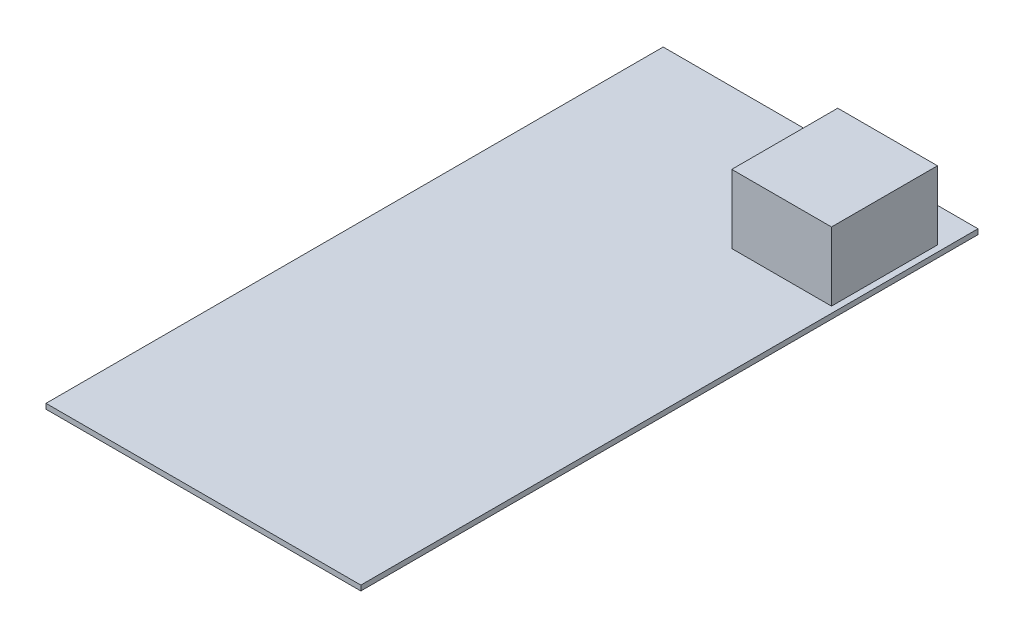
ISO-10303-21;
HEADER;
FILE_DESCRIPTION(('STEP AP214'),'2;1');
FILE_NAME('part.step','',(''),(''),'','','');
FILE_SCHEMA(('AUTOMOTIVE_DESIGN { 1 0 10303 214 1 1 1 1 }'));
ENDSEC;
DATA;
#1=APPLICATION_CONTEXT('core data for automotive mechanical design processes');
#2=APPLICATION_PROTOCOL_DEFINITION('international standard','automotive_design',2000,#1);
#3=PRODUCT_CONTEXT('',#1,'mechanical');
#4=PRODUCT('Part','Part','',(#3));
#5=PRODUCT_RELATED_PRODUCT_CATEGORY('part','',(#4));
#6=PRODUCT_DEFINITION_FORMATION('','',#4);
#7=PRODUCT_DEFINITION_CONTEXT('part definition',#1,'design');
#8=PRODUCT_DEFINITION('design','',#6,#7);
#9=PRODUCT_DEFINITION_SHAPE('','',#8);
#10=(LENGTH_UNIT() NAMED_UNIT(*) SI_UNIT(.MILLI.,.METRE.));
#11=(NAMED_UNIT(*) PLANE_ANGLE_UNIT() SI_UNIT($,.RADIAN.));
#12=(NAMED_UNIT(*) SI_UNIT($,.STERADIAN.) SOLID_ANGLE_UNIT());
#13=UNCERTAINTY_MEASURE_WITH_UNIT(LENGTH_MEASURE(1.E-05),#10,'distance_accuracy_value','');
#14=(GEOMETRIC_REPRESENTATION_CONTEXT(3) GLOBAL_UNCERTAINTY_ASSIGNED_CONTEXT((#13)) GLOBAL_UNIT_ASSIGNED_CONTEXT((#10,
#11,#12)) REPRESENTATION_CONTEXT('',''));
#15=CARTESIAN_POINT('',(0.,0.,0.));
#16=DIRECTION('',(0.,0.,1.));
#17=DIRECTION('',(1.,0.,0.));
#18=AXIS2_PLACEMENT_3D('',#15,#16,#17);
#19=CARTESIAN_POINT('',(0.,1.65,0.));
#20=DIRECTION('',(0.,1.,0.));
#21=DIRECTION('',(0.,0.,1.));
#22=AXIS2_PLACEMENT_3D('',#19,#20,#21);
#23=PLANE('',#22);
#24=DIRECTION('',(0.,0.,-1.));
#25=VECTOR('',#24,1.);
#26=CARTESIAN_POINT('',(50.5,1.65,-99.));
#27=LINE('',#26,#25);
#28=CARTESIAN_POINT('',(50.5,1.65,99.));
#29=VERTEX_POINT('',#28);
#30=CARTESIAN_POINT('',(50.5,1.65,-99.));
#31=VERTEX_POINT('',#30);
#32=EDGE_CURVE('E140',#29,#31,#27,.T.);
#33=ORIENTED_EDGE('',*,*,#32,.T.);
#34=DIRECTION('',(-1.,0.,0.));
#35=VECTOR('',#34,1.);
#36=CARTESIAN_POINT('',(-50.5,1.65,-99.));
#37=LINE('',#36,#35);
#38=CARTESIAN_POINT('',(-50.5,1.65,-99.));
#39=VERTEX_POINT('',#38);
#40=EDGE_CURVE('E85',#31,#39,#37,.T.);
#41=ORIENTED_EDGE('',*,*,#40,.T.);
#42=DIRECTION('',(0.,0.,1.));
#43=VECTOR('',#42,1.);
#44=CARTESIAN_POINT('',(-50.5,1.65,-99.));
#45=LINE('',#44,#43);
#46=CARTESIAN_POINT('',(-50.5,1.65,99.));
#47=VERTEX_POINT('',#46);
#48=EDGE_CURVE('E143',#39,#47,#45,.T.);
#49=ORIENTED_EDGE('',*,*,#48,.T.);
#50=DIRECTION('',(1.,0.,0.));
#51=VECTOR('',#50,1.);
#52=CARTESIAN_POINT('',(-50.5,1.65,99.));
#53=LINE('',#52,#51);
#54=EDGE_CURVE('E57',#47,#29,#53,.T.);
#55=ORIENTED_EDGE('',*,*,#54,.T.);
#56=EDGE_LOOP('',(#33,#41,#49,#55));
#57=FACE_BOUND('',#56,.T.);
#58=DIRECTION('',(1.,0.,0.));
#59=VECTOR('',#58,1.);
#60=CARTESIAN_POINT('',(16.5,1.65,-54.));
#61=LINE('',#60,#59);
#62=CARTESIAN_POINT('',(16.5,1.65,-54.));
#63=VERTEX_POINT('',#62);
#64=CARTESIAN_POINT('',(48.5,1.65,-54.));
#65=VERTEX_POINT('',#64);
#66=EDGE_CURVE('E263',#63,#65,#61,.T.);
#67=ORIENTED_EDGE('',*,*,#66,.F.);
#68=DIRECTION('',(0.,0.,1.));
#69=VECTOR('',#68,1.);
#70=CARTESIAN_POINT('',(16.5,1.65,-88.));
#71=LINE('',#70,#69);
#72=CARTESIAN_POINT('',(16.5,1.65,-88.));
#73=VERTEX_POINT('',#72);
#74=EDGE_CURVE('E130',#73,#63,#71,.T.);
#75=ORIENTED_EDGE('',*,*,#74,.F.);
#76=DIRECTION('',(-1.,0.,0.));
#77=VECTOR('',#76,1.);
#78=CARTESIAN_POINT('',(16.5,1.65,-88.));
#79=LINE('',#78,#77);
#80=CARTESIAN_POINT('',(48.5,1.65,-88.));
#81=VERTEX_POINT('',#80);
#82=EDGE_CURVE('E126',#81,#73,#79,.T.);
#83=ORIENTED_EDGE('',*,*,#82,.F.);
#84=DIRECTION('',(0.,0.,-1.));
#85=VECTOR('',#84,1.);
#86=CARTESIAN_POINT('',(48.5,1.65,-88.));
#87=LINE('',#86,#85);
#88=EDGE_CURVE('E260',#65,#81,#87,.T.);
#89=ORIENTED_EDGE('',*,*,#88,.F.);
#90=EDGE_LOOP('',(#67,#75,#83,#89));
#91=FACE_BOUND('',#90,.T.);
#92=ADVANCED_FACE('F33',(#57,#91),#23,.T.);
#93=CARTESIAN_POINT('',(50.5,1.65,-99.));
#94=DIRECTION('',(-1.,0.,0.));
#95=DIRECTION('',(0.,0.,1.));
#96=AXIS2_PLACEMENT_3D('',#93,#94,#95);
#97=PLANE('',#96);
#98=DIRECTION('',(0.,0.,-1.));
#99=VECTOR('',#98,1.);
#100=CARTESIAN_POINT('',(50.5,0.,-99.));
#101=LINE('',#100,#99);
#102=CARTESIAN_POINT('',(50.5,0.,99.));
#103=VERTEX_POINT('',#102);
#104=CARTESIAN_POINT('',(50.5,0.,-99.));
#105=VERTEX_POINT('',#104);
#106=EDGE_CURVE('E132',#103,#105,#101,.T.);
#107=ORIENTED_EDGE('',*,*,#106,.T.);
#108=DIRECTION('',(0.,-1.,0.));
#109=VECTOR('',#108,1.);
#110=CARTESIAN_POINT('',(50.5,1.65,-99.));
#111=LINE('',#110,#109);
#112=EDGE_CURVE('E11',#31,#105,#111,.T.);
#113=ORIENTED_EDGE('',*,*,#112,.F.);
#114=ORIENTED_EDGE('',*,*,#32,.F.);
#115=DIRECTION('',(0.,-1.,0.));
#116=VECTOR('',#115,1.);
#117=CARTESIAN_POINT('',(50.5,1.65,99.));
#118=LINE('',#117,#116);
#119=EDGE_CURVE('E145',#29,#103,#118,.T.);
#120=ORIENTED_EDGE('',*,*,#119,.T.);
#121=EDGE_LOOP('',(#107,#113,#114,#120));
#122=FACE_BOUND('',#121,.T.);
#123=ADVANCED_FACE('F35',(#122),#97,.F.);
#124=CARTESIAN_POINT('',(-50.5,1.65,-99.));
#125=DIRECTION('',(0.,0.,1.));
#126=DIRECTION('',(1.,0.,0.));
#127=AXIS2_PLACEMENT_3D('',#124,#125,#126);
#128=PLANE('',#127);
#129=DIRECTION('',(-1.,0.,0.));
#130=VECTOR('',#129,1.);
#131=CARTESIAN_POINT('',(-50.5,0.,-99.));
#132=LINE('',#131,#130);
#133=CARTESIAN_POINT('',(-50.5,0.,-99.));
#134=VERTEX_POINT('',#133);
#135=EDGE_CURVE('E135',#105,#134,#132,.T.);
#136=ORIENTED_EDGE('',*,*,#135,.T.);
#137=DIRECTION('',(0.,-1.,0.));
#138=VECTOR('',#137,1.);
#139=CARTESIAN_POINT('',(-50.5,1.65,-99.));
#140=LINE('',#139,#138);
#141=EDGE_CURVE('E41',#39,#134,#140,.T.);
#142=ORIENTED_EDGE('',*,*,#141,.F.);
#143=ORIENTED_EDGE('',*,*,#40,.F.);
#144=ORIENTED_EDGE('',*,*,#112,.T.);
#145=EDGE_LOOP('',(#136,#142,#143,#144));
#146=FACE_BOUND('',#145,.T.);
#147=ADVANCED_FACE('F173',(#146),#128,.F.);
#148=CARTESIAN_POINT('',(-50.5,1.65,-99.));
#149=DIRECTION('',(1.,0.,0.));
#150=DIRECTION('',(0.,0.,-1.));
#151=AXIS2_PLACEMENT_3D('',#148,#149,#150);
#152=PLANE('',#151);
#153=DIRECTION('',(0.,0.,1.));
#154=VECTOR('',#153,1.);
#155=CARTESIAN_POINT('',(-50.5,0.,-99.));
#156=LINE('',#155,#154);
#157=CARTESIAN_POINT('',(-50.5,0.,99.));
#158=VERTEX_POINT('',#157);
#159=EDGE_CURVE('E148',#134,#158,#156,.T.);
#160=ORIENTED_EDGE('',*,*,#159,.T.);
#161=DIRECTION('',(0.,-1.,0.));
#162=VECTOR('',#161,1.);
#163=CARTESIAN_POINT('',(-50.5,1.65,99.));
#164=LINE('',#163,#162);
#165=EDGE_CURVE('E152',#47,#158,#164,.T.);
#166=ORIENTED_EDGE('',*,*,#165,.F.);
#167=ORIENTED_EDGE('',*,*,#48,.F.);
#168=ORIENTED_EDGE('',*,*,#141,.T.);
#169=EDGE_LOOP('',(#160,#166,#167,#168));
#170=FACE_BOUND('',#169,.T.);
#171=ADVANCED_FACE('F157',(#170),#152,.F.);
#172=CARTESIAN_POINT('',(-50.5,1.65,99.));
#173=DIRECTION('',(0.,0.,-1.));
#174=DIRECTION('',(-1.,0.,0.));
#175=AXIS2_PLACEMENT_3D('',#172,#173,#174);
#176=PLANE('',#175);
#177=DIRECTION('',(1.,0.,0.));
#178=VECTOR('',#177,1.);
#179=CARTESIAN_POINT('',(-50.5,0.,99.));
#180=LINE('',#179,#178);
#181=EDGE_CURVE('E78',#158,#103,#180,.T.);
#182=ORIENTED_EDGE('',*,*,#181,.T.);
#183=ORIENTED_EDGE('',*,*,#119,.F.);
#184=ORIENTED_EDGE('',*,*,#54,.F.);
#185=ORIENTED_EDGE('',*,*,#165,.T.);
#186=EDGE_LOOP('',(#182,#183,#184,#185));
#187=FACE_BOUND('',#186,.T.);
#188=ADVANCED_FACE('F165',(#187),#176,.F.);
#189=CARTESIAN_POINT('',(0.,0.,0.));
#190=DIRECTION('',(0.,1.,0.));
#191=DIRECTION('',(0.,0.,1.));
#192=AXIS2_PLACEMENT_3D('',#189,#190,#191);
#193=PLANE('',#192);
#194=ORIENTED_EDGE('',*,*,#106,.F.);
#195=ORIENTED_EDGE('',*,*,#181,.F.);
#196=ORIENTED_EDGE('',*,*,#159,.F.);
#197=ORIENTED_EDGE('',*,*,#135,.F.);
#198=EDGE_LOOP('',(#194,#195,#196,#197));
#199=FACE_BOUND('',#198,.T.);
#200=ADVANCED_FACE('F161',(#199),#193,.F.);
#201=CARTESIAN_POINT('',(16.5,23.65,-88.));
#202=DIRECTION('',(1.,0.,0.));
#203=DIRECTION('',(0.,0.,-1.));
#204=AXIS2_PLACEMENT_3D('',#201,#202,#203);
#205=PLANE('',#204);
#206=ORIENTED_EDGE('',*,*,#74,.T.);
#207=DIRECTION('',(0.,-1.,0.));
#208=VECTOR('',#207,1.);
#209=CARTESIAN_POINT('',(16.5,23.65,-54.));
#210=LINE('',#209,#208);
#211=CARTESIAN_POINT('',(16.5,23.65,-54.));
#212=VERTEX_POINT('',#211);
#213=EDGE_CURVE('E111',#212,#63,#210,.T.);
#214=ORIENTED_EDGE('',*,*,#213,.F.);
#215=DIRECTION('',(0.,0.,1.));
#216=VECTOR('',#215,1.);
#217=CARTESIAN_POINT('',(16.5,23.65,-88.));
#218=LINE('',#217,#216);
#219=CARTESIAN_POINT('',(16.5,23.65,-88.));
#220=VERTEX_POINT('',#219);
#221=EDGE_CURVE('E118',#220,#212,#218,.T.);
#222=ORIENTED_EDGE('',*,*,#221,.F.);
#223=DIRECTION('',(0.,-1.,0.));
#224=VECTOR('',#223,1.);
#225=CARTESIAN_POINT('',(16.5,23.65,-88.));
#226=LINE('',#225,#224);
#227=EDGE_CURVE('E258',#220,#73,#226,.T.);
#228=ORIENTED_EDGE('',*,*,#227,.T.);
#229=EDGE_LOOP('',(#206,#214,#222,#228));
#230=FACE_BOUND('',#229,.T.);
#231=ADVANCED_FACE('F128',(#230),#205,.F.);
#232=CARTESIAN_POINT('',(16.5,23.65,-54.));
#233=DIRECTION('',(0.,0.,-1.));
#234=DIRECTION('',(-1.,0.,0.));
#235=AXIS2_PLACEMENT_3D('',#232,#233,#234);
#236=PLANE('',#235);
#237=ORIENTED_EDGE('',*,*,#66,.T.);
#238=DIRECTION('',(0.,-1.,0.));
#239=VECTOR('',#238,1.);
#240=CARTESIAN_POINT('',(48.5,23.65,-54.));
#241=LINE('',#240,#239);
#242=CARTESIAN_POINT('',(48.5,23.65,-54.));
#243=VERTEX_POINT('',#242);
#244=EDGE_CURVE('E114',#243,#65,#241,.T.);
#245=ORIENTED_EDGE('',*,*,#244,.F.);
#246=DIRECTION('',(1.,0.,0.));
#247=VECTOR('',#246,1.);
#248=CARTESIAN_POINT('',(16.5,23.65,-54.));
#249=LINE('',#248,#247);
#250=EDGE_CURVE('E107',#212,#243,#249,.T.);
#251=ORIENTED_EDGE('',*,*,#250,.F.);
#252=ORIENTED_EDGE('',*,*,#213,.T.);
#253=EDGE_LOOP('',(#237,#245,#251,#252));
#254=FACE_BOUND('',#253,.T.);
#255=ADVANCED_FACE('F109',(#254),#236,.F.);
#256=CARTESIAN_POINT('',(48.5,23.65,-88.));
#257=DIRECTION('',(-1.,0.,0.));
#258=DIRECTION('',(0.,0.,1.));
#259=AXIS2_PLACEMENT_3D('',#256,#257,#258);
#260=PLANE('',#259);
#261=ORIENTED_EDGE('',*,*,#88,.T.);
#262=DIRECTION('',(0.,-1.,0.));
#263=VECTOR('',#262,1.);
#264=CARTESIAN_POINT('',(48.5,23.65,-88.));
#265=LINE('',#264,#263);
#266=CARTESIAN_POINT('',(48.5,23.65,-88.));
#267=VERTEX_POINT('',#266);
#268=EDGE_CURVE('E48',#267,#81,#265,.T.);
#269=ORIENTED_EDGE('',*,*,#268,.F.);
#270=DIRECTION('',(0.,0.,-1.));
#271=VECTOR('',#270,1.);
#272=CARTESIAN_POINT('',(48.5,23.65,-88.));
#273=LINE('',#272,#271);
#274=EDGE_CURVE('E117',#243,#267,#273,.T.);
#275=ORIENTED_EDGE('',*,*,#274,.F.);
#276=ORIENTED_EDGE('',*,*,#244,.T.);
#277=EDGE_LOOP('',(#261,#269,#275,#276));
#278=FACE_BOUND('',#277,.T.);
#279=ADVANCED_FACE('F186',(#278),#260,.F.);
#280=CARTESIAN_POINT('',(16.5,23.65,-88.));
#281=DIRECTION('',(0.,0.,1.));
#282=DIRECTION('',(1.,0.,0.));
#283=AXIS2_PLACEMENT_3D('',#280,#281,#282);
#284=PLANE('',#283);
#285=ORIENTED_EDGE('',*,*,#82,.T.);
#286=ORIENTED_EDGE('',*,*,#227,.F.);
#287=DIRECTION('',(-1.,0.,0.));
#288=VECTOR('',#287,1.);
#289=CARTESIAN_POINT('',(16.5,23.65,-88.));
#290=LINE('',#289,#288);
#291=EDGE_CURVE('E122',#267,#220,#290,.T.);
#292=ORIENTED_EDGE('',*,*,#291,.F.);
#293=ORIENTED_EDGE('',*,*,#268,.T.);
#294=EDGE_LOOP('',(#285,#286,#292,#293));
#295=FACE_BOUND('',#294,.T.);
#296=ADVANCED_FACE('F189',(#295),#284,.F.);
#297=CARTESIAN_POINT('',(0.,23.65,0.));
#298=DIRECTION('',(0.,1.,0.));
#299=DIRECTION('',(0.,0.,1.));
#300=AXIS2_PLACEMENT_3D('',#297,#298,#299);
#301=PLANE('',#300);
#302=ORIENTED_EDGE('',*,*,#221,.T.);
#303=ORIENTED_EDGE('',*,*,#250,.T.);
#304=ORIENTED_EDGE('',*,*,#274,.T.);
#305=ORIENTED_EDGE('',*,*,#291,.T.);
#306=EDGE_LOOP('',(#302,#303,#304,#305));
#307=FACE_BOUND('',#306,.T.);
#308=ADVANCED_FACE('F121',(#307),#301,.T.);
#309=CLOSED_SHELL('',(#92,#123,#147,#171,#188,#200,#231,#255,#279,#296,#308));
#310=MANIFOLD_SOLID_BREP('B2',#309);
#311=ADVANCED_BREP_SHAPE_REPRESENTATION('',(#18,#310),#14);
#312=SHAPE_DEFINITION_REPRESENTATION(#9,#311);
ENDSEC;
END-ISO-10303-21;
